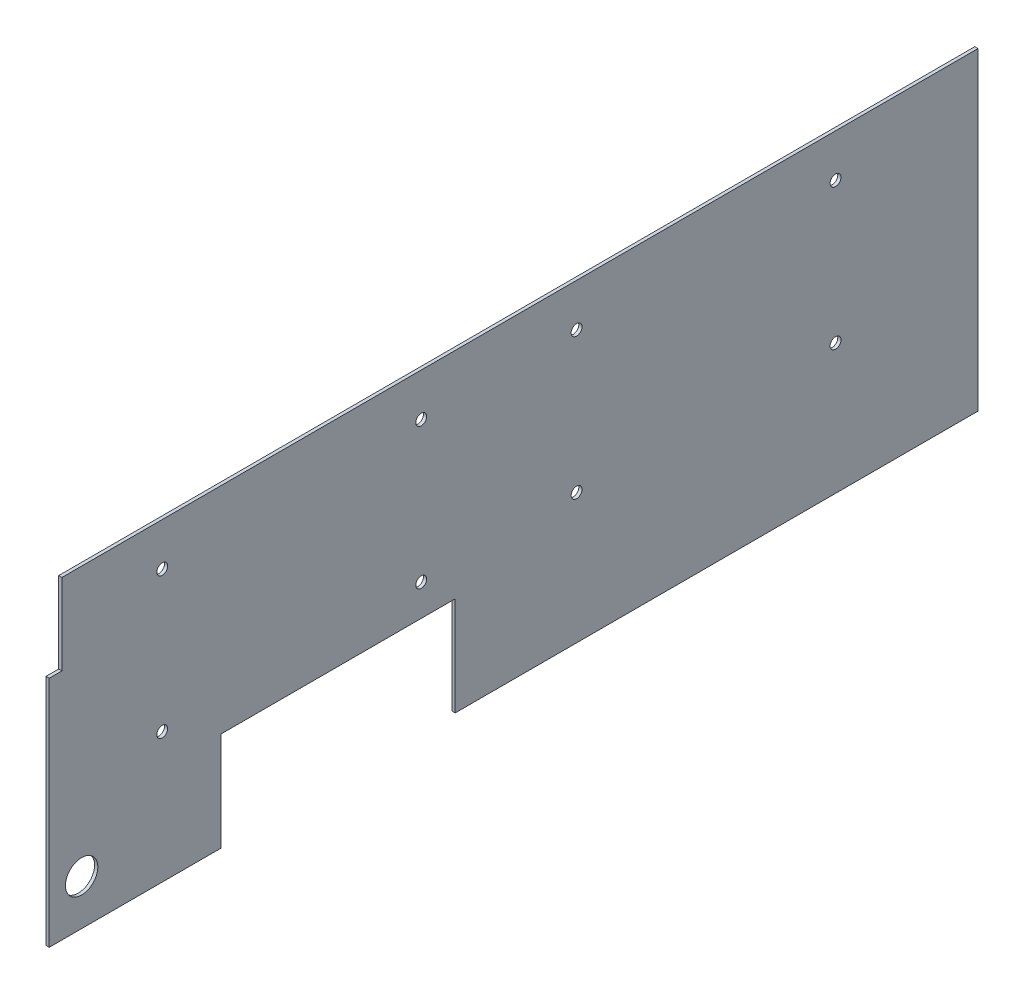
ISO-10303-21;
HEADER;
FILE_DESCRIPTION(('STEP AP214'),'2;1');
FILE_NAME('part.step','',(''),(''),'','','');
FILE_SCHEMA(('AUTOMOTIVE_DESIGN { 1 0 10303 214 1 1 1 1 }'));
ENDSEC;
DATA;
#1=APPLICATION_CONTEXT('core data for automotive mechanical design processes');
#2=APPLICATION_PROTOCOL_DEFINITION('international standard','automotive_design',2000,#1);
#3=PRODUCT_CONTEXT('',#1,'mechanical');
#4=PRODUCT('Part','Part','',(#3));
#5=PRODUCT_RELATED_PRODUCT_CATEGORY('part','',(#4));
#6=PRODUCT_DEFINITION_FORMATION('','',#4);
#7=PRODUCT_DEFINITION_CONTEXT('part definition',#1,'design');
#8=PRODUCT_DEFINITION('design','',#6,#7);
#9=PRODUCT_DEFINITION_SHAPE('','',#8);
#10=(LENGTH_UNIT() NAMED_UNIT(*) SI_UNIT(.MILLI.,.METRE.));
#11=(NAMED_UNIT(*) PLANE_ANGLE_UNIT() SI_UNIT($,.RADIAN.));
#12=(NAMED_UNIT(*) SI_UNIT($,.STERADIAN.) SOLID_ANGLE_UNIT());
#13=UNCERTAINTY_MEASURE_WITH_UNIT(LENGTH_MEASURE(1.E-05),#10,'distance_accuracy_value','');
#14=(GEOMETRIC_REPRESENTATION_CONTEXT(3) GLOBAL_UNCERTAINTY_ASSIGNED_CONTEXT((#13)) GLOBAL_UNIT_ASSIGNED_CONTEXT((#10,
#11,#12)) REPRESENTATION_CONTEXT('',''));
#15=CARTESIAN_POINT('',(0.,0.,0.));
#16=DIRECTION('',(0.,0.,1.));
#17=DIRECTION('',(1.,0.,0.));
#18=AXIS2_PLACEMENT_3D('',#15,#16,#17);
#19=CARTESIAN_POINT('',(1.5875,-76.99375,227.734090886));
#20=DIRECTION('',(0.,0.,-1.));
#21=DIRECTION('',(-1.,0.,0.));
#22=AXIS2_PLACEMENT_3D('',#19,#20,#21);
#23=PLANE('',#22);
#24=DIRECTION('',(-1.,0.,0.));
#25=VECTOR('',#24,1.);
#26=CARTESIAN_POINT('',(126.340744793055,37.30625,227.734090886));
#27=LINE('',#26,#25);
#28=CARTESIAN_POINT('',(1.58750000000001,37.30625,227.734090886));
#29=VERTEX_POINT('',#28);
#30=CARTESIAN_POINT('',(0.,37.30625,227.734090886));
#31=VERTEX_POINT('',#30);
#32=EDGE_CURVE('E176',#29,#31,#27,.T.);
#33=ORIENTED_EDGE('',*,*,#32,.T.);
#34=DIRECTION('',(0.,-1.,0.));
#35=VECTOR('',#34,1.);
#36=CARTESIAN_POINT('',(0.,-76.99375,227.734090886));
#37=LINE('',#36,#35);
#38=CARTESIAN_POINT('',(0.,-76.99375,227.734090886));
#39=VERTEX_POINT('',#38);
#40=EDGE_CURVE('E142',#31,#39,#37,.T.);
#41=ORIENTED_EDGE('',*,*,#40,.T.);
#42=DIRECTION('',(-1.,0.,0.));
#43=VECTOR('',#42,1.);
#44=CARTESIAN_POINT('',(1.5875,-76.99375,227.734090886));
#45=LINE('',#44,#43);
#46=CARTESIAN_POINT('',(1.5875,-76.99375,227.734090886));
#47=VERTEX_POINT('',#46);
#48=EDGE_CURVE('E44',#47,#39,#45,.T.);
#49=ORIENTED_EDGE('',*,*,#48,.F.);
#50=DIRECTION('',(0.,-1.,0.));
#51=VECTOR('',#50,1.);
#52=CARTESIAN_POINT('',(1.5875,-76.99375,227.734090886));
#53=LINE('',#52,#51);
#54=EDGE_CURVE('E199',#29,#47,#53,.T.);
#55=ORIENTED_EDGE('',*,*,#54,.F.);
#56=EDGE_LOOP('',(#33,#41,#49,#55));
#57=FACE_BOUND('',#56,.T.);
#58=ADVANCED_FACE('F36',(#57),#23,.F.);
#59=CARTESIAN_POINT('',(1.5875,-76.99375,227.734090886));
#60=DIRECTION('',(0.,1.,0.));
#61=DIRECTION('',(0.,0.,1.));
#62=AXIS2_PLACEMENT_3D('',#59,#60,#61);
#63=PLANE('',#62);
#64=DIRECTION('',(-1.,0.,0.));
#65=VECTOR('',#64,1.);
#66=CARTESIAN_POINT('',(126.340744793055,-76.99375,28.647159114));
#67=LINE('',#66,#65);
#68=CARTESIAN_POINT('',(1.58750000000001,-76.99375,28.647159114));
#69=VERTEX_POINT('',#68);
#70=CARTESIAN_POINT('',(0.,-76.99375,28.647159114));
#71=VERTEX_POINT('',#70);
#72=EDGE_CURVE('E117',#69,#71,#67,.T.);
#73=ORIENTED_EDGE('',*,*,#72,.T.);
#74=DIRECTION('',(0.,0.,-1.));
#75=VECTOR('',#74,1.);
#76=CARTESIAN_POINT('',(0.,-76.99375,227.734090886));
#77=LINE('',#76,#75);
#78=CARTESIAN_POINT('',(0.,-76.99375,-227.734090886));
#79=VERTEX_POINT('',#78);
#80=EDGE_CURVE('E132',#71,#79,#77,.T.);
#81=ORIENTED_EDGE('',*,*,#80,.T.);
#82=DIRECTION('',(-1.,0.,0.));
#83=VECTOR('',#82,1.);
#84=CARTESIAN_POINT('',(1.5875,-76.99375,-227.734090886));
#85=LINE('',#84,#83);
#86=CARTESIAN_POINT('',(1.5875,-76.99375,-227.734090886));
#87=VERTEX_POINT('',#86);
#88=EDGE_CURVE('E150',#87,#79,#85,.T.);
#89=ORIENTED_EDGE('',*,*,#88,.F.);
#90=DIRECTION('',(0.,0.,-1.));
#91=VECTOR('',#90,1.);
#92=CARTESIAN_POINT('',(1.5875,-76.99375,227.734090886));
#93=LINE('',#92,#91);
#94=EDGE_CURVE('E134',#69,#87,#93,.T.);
#95=ORIENTED_EDGE('',*,*,#94,.F.);
#96=EDGE_LOOP('',(#73,#81,#89,#95));
#97=FACE_BOUND('',#96,.T.);
#98=ADVANCED_FACE('F130',(#97),#63,.F.);
#99=CARTESIAN_POINT('',(1.5875,0.,0.));
#100=DIRECTION('',(-1.,0.,0.));
#101=DIRECTION('',(0.,0.,1.));
#102=AXIS2_PLACEMENT_3D('',#99,#100,#101);
#103=PLANE('',#102);
#104=CARTESIAN_POINT('',(1.5875,55.959375,-30.884090886));
#105=DIRECTION('',(1.,0.,0.));
#106=DIRECTION('',(0.,0.,-1.));
#107=AXIS2_PLACEMENT_3D('',#104,#105,#106);
#108=CIRCLE('',#107,2.667);
#109=CARTESIAN_POINT('',(1.5875,55.959375,-33.551090886));
#110=VERTEX_POINT('',#109);
#111=EDGE_CURVE('E311',#110,#110,#108,.T.);
#112=ORIENTED_EDGE('',*,*,#111,.F.);
#113=EDGE_LOOP('',(#112));
#114=FACE_BOUND('',#113,.T.);
#115=CARTESIAN_POINT('',(1.5875,55.959375,45.315909114));
#116=DIRECTION('',(1.,0.,0.));
#117=DIRECTION('',(0.,0.,-1.));
#118=AXIS2_PLACEMENT_3D('',#115,#116,#117);
#119=CIRCLE('',#118,2.667);
#120=CARTESIAN_POINT('',(1.5875,55.959375,42.648909114));
#121=VERTEX_POINT('',#120);
#122=EDGE_CURVE('E319',#121,#121,#119,.T.);
#123=ORIENTED_EDGE('',*,*,#122,.F.);
#124=EDGE_LOOP('',(#123));
#125=FACE_BOUND('',#124,.T.);
#126=CARTESIAN_POINT('',(1.5875,55.959375,172.315909114));
#127=DIRECTION('',(1.,0.,0.));
#128=DIRECTION('',(0.,0.,-1.));
#129=AXIS2_PLACEMENT_3D('',#126,#127,#128);
#130=CIRCLE('',#129,2.667);
#131=CARTESIAN_POINT('',(1.5875,55.959375,169.648909114));
#132=VERTEX_POINT('',#131);
#133=EDGE_CURVE('E325',#132,#132,#130,.T.);
#134=ORIENTED_EDGE('',*,*,#133,.F.);
#135=EDGE_LOOP('',(#134));
#136=FACE_BOUND('',#135,.T.);
#137=CARTESIAN_POINT('',(1.5875,-13.096875,172.315909114));
#138=DIRECTION('',(1.,0.,0.));
#139=DIRECTION('',(0.,0.,-1.));
#140=AXIS2_PLACEMENT_3D('',#137,#138,#139);
#141=CIRCLE('',#140,2.667);
#142=CARTESIAN_POINT('',(1.5875,-13.096875,169.648909114));
#143=VERTEX_POINT('',#142);
#144=EDGE_CURVE('E292',#143,#143,#141,.T.);
#145=ORIENTED_EDGE('',*,*,#144,.F.);
#146=EDGE_LOOP('',(#145));
#147=FACE_BOUND('',#146,.T.);
#148=CARTESIAN_POINT('',(1.5875,-13.096875,45.315909114));
#149=DIRECTION('',(1.,0.,0.));
#150=DIRECTION('',(0.,0.,-1.));
#151=AXIS2_PLACEMENT_3D('',#148,#149,#150);
#152=CIRCLE('',#151,2.667);
#153=CARTESIAN_POINT('',(1.5875,-13.096875,42.648909114));
#154=VERTEX_POINT('',#153);
#155=EDGE_CURVE('E287',#154,#154,#152,.T.);
#156=ORIENTED_EDGE('',*,*,#155,.F.);
#157=EDGE_LOOP('',(#156));
#158=FACE_BOUND('',#157,.T.);
#159=CARTESIAN_POINT('',(1.5875,-13.096875,-30.884090886));
#160=DIRECTION('',(1.,0.,0.));
#161=DIRECTION('',(0.,0.,-1.));
#162=AXIS2_PLACEMENT_3D('',#159,#160,#161);
#163=CIRCLE('',#162,2.667);
#164=CARTESIAN_POINT('',(1.5875,-13.096875,-33.551090886));
#165=VERTEX_POINT('',#164);
#166=EDGE_CURVE('E300',#165,#165,#163,.T.);
#167=ORIENTED_EDGE('',*,*,#166,.F.);
#168=EDGE_LOOP('',(#167));
#169=FACE_BOUND('',#168,.T.);
#170=CARTESIAN_POINT('',(1.5875,-13.096875,-157.884090886));
#171=DIRECTION('',(1.,0.,0.));
#172=DIRECTION('',(0.,0.,-1.));
#173=AXIS2_PLACEMENT_3D('',#170,#171,#172);
#174=CIRCLE('',#173,2.66700000000002);
#175=CARTESIAN_POINT('',(1.5875,-13.096875,-160.551090886));
#176=VERTEX_POINT('',#175);
#177=EDGE_CURVE('E306',#176,#176,#174,.T.);
#178=ORIENTED_EDGE('',*,*,#177,.F.);
#179=EDGE_LOOP('',(#178));
#180=FACE_BOUND('',#179,.T.);
#181=CARTESIAN_POINT('',(1.5875,55.959375,-157.884090886));
#182=DIRECTION('',(1.,0.,0.));
#183=DIRECTION('',(0.,0.,-1.));
#184=AXIS2_PLACEMENT_3D('',#181,#182,#183);
#185=CIRCLE('',#184,2.66700000000002);
#186=CARTESIAN_POINT('',(1.5875,55.959375,-160.551090886));
#187=VERTEX_POINT('',#186);
#188=EDGE_CURVE('E318',#187,#187,#185,.T.);
#189=ORIENTED_EDGE('',*,*,#188,.F.);
#190=EDGE_LOOP('',(#189));
#191=FACE_BOUND('',#190,.T.);
#192=CARTESIAN_POINT('',(1.58750000000001,-54.7687499999999,211.85909093172));
#193=DIRECTION('',(-1.,0.,0.));
#194=DIRECTION('',(0.,0.,1.));
#195=AXIS2_PLACEMENT_3D('',#192,#193,#194);
#196=CIRCLE('',#195,7.93750000000001);
#197=CARTESIAN_POINT('',(1.58750000000001,-54.7687499999999,219.79659093172));
#198=VERTEX_POINT('',#197);
#199=EDGE_CURVE('E180',#198,#198,#196,.F.);
#200=ORIENTED_EDGE('',*,*,#199,.F.);
#201=EDGE_LOOP('',(#200));
#202=FACE_BOUND('',#201,.T.);
#203=DIRECTION('',(0.,-1.,0.));
#204=VECTOR('',#203,1.);
#205=CARTESIAN_POINT('',(1.58750000000001,0.,28.647159114));
#206=LINE('',#205,#204);
#207=CARTESIAN_POINT('',(1.58750000000001,-28.5169491392768,28.647159114));
#208=VERTEX_POINT('',#207);
#209=EDGE_CURVE('E202',#208,#69,#206,.T.);
#210=ORIENTED_EDGE('',*,*,#209,.T.);
#211=ORIENTED_EDGE('',*,*,#94,.T.);
#212=DIRECTION('',(0.,1.,0.));
#213=VECTOR('',#212,1.);
#214=CARTESIAN_POINT('',(1.5875,-76.99375,-227.734090886));
#215=LINE('',#214,#213);
#216=CARTESIAN_POINT('',(1.5875,76.99375,-227.734090886));
#217=VERTEX_POINT('',#216);
#218=EDGE_CURVE('E145',#87,#217,#215,.T.);
#219=ORIENTED_EDGE('',*,*,#218,.T.);
#220=DIRECTION('',(0.,0.,1.));
#221=VECTOR('',#220,1.);
#222=CARTESIAN_POINT('',(1.5875,76.99375,227.734090886));
#223=LINE('',#222,#221);
#224=CARTESIAN_POINT('',(1.58750000000001,76.99375,221.528409114));
#225=VERTEX_POINT('',#224);
#226=EDGE_CURVE('E196',#217,#225,#223,.T.);
#227=ORIENTED_EDGE('',*,*,#226,.T.);
#228=DIRECTION('',(0.,1.,0.));
#229=VECTOR('',#228,1.);
#230=CARTESIAN_POINT('',(1.58750000000001,0.,221.528409114));
#231=LINE('',#230,#229);
#232=CARTESIAN_POINT('',(1.58750000000001,37.3062500000001,221.528409114));
#233=VERTEX_POINT('',#232);
#234=EDGE_CURVE('E126',#233,#225,#231,.T.);
#235=ORIENTED_EDGE('',*,*,#234,.F.);
#236=DIRECTION('',(0.,0.,1.));
#237=VECTOR('',#236,1.);
#238=CARTESIAN_POINT('',(1.58750000000001,37.306250000002,3.33712388373696E-13));
#239=LINE('',#238,#237);
#240=EDGE_CURVE('E173',#233,#29,#239,.T.);
#241=ORIENTED_EDGE('',*,*,#240,.T.);
#242=ORIENTED_EDGE('',*,*,#54,.T.);
#243=CARTESIAN_POINT('',(1.58750000000001,-76.99375,143.596590886));
#244=VERTEX_POINT('',#243);
#245=EDGE_CURVE('E151',#47,#244,#93,.T.);
#246=ORIENTED_EDGE('',*,*,#245,.T.);
#247=DIRECTION('',(0.,-1.,0.));
#248=VECTOR('',#247,1.);
#249=CARTESIAN_POINT('',(1.58750000000001,0.,143.596590886));
#250=LINE('',#249,#248);
#251=CARTESIAN_POINT('',(1.58750000000001,-28.5169491392767,143.596590886));
#252=VERTEX_POINT('',#251);
#253=EDGE_CURVE('E169',#252,#244,#250,.T.);
#254=ORIENTED_EDGE('',*,*,#253,.F.);
#255=DIRECTION('',(0.,0.,1.));
#256=VECTOR('',#255,1.);
#257=CARTESIAN_POINT('',(1.58750000000001,-28.5169491392768,0.));
#258=LINE('',#257,#256);
#259=EDGE_CURVE('E337',#208,#252,#258,.T.);
#260=ORIENTED_EDGE('',*,*,#259,.F.);
#261=EDGE_LOOP('',(#210,#211,#219,#227,#235,#241,#242,#246,#254,#260));
#262=FACE_BOUND('',#261,.T.);
#263=ADVANCED_FACE('F212',(#114,#125,#136,#147,#158,#169,#180,#191,#202,#262),#103,.F.);
#264=CARTESIAN_POINT('',(0.,0.,0.));
#265=DIRECTION('',(-1.,0.,0.));
#266=DIRECTION('',(0.,0.,1.));
#267=AXIS2_PLACEMENT_3D('',#264,#265,#266);
#268=PLANE('',#267);
#269=CARTESIAN_POINT('',(0.,55.959375,-30.884090886));
#270=DIRECTION('',(-1.,0.,0.));
#271=DIRECTION('',(0.,0.,1.));
#272=AXIS2_PLACEMENT_3D('',#269,#270,#271);
#273=CIRCLE('',#272,2.667);
#274=CARTESIAN_POINT('',(0.,55.959375,-28.217090886));
#275=VERTEX_POINT('',#274);
#276=EDGE_CURVE('E314',#275,#275,#273,.F.);
#277=ORIENTED_EDGE('',*,*,#276,.T.);
#278=EDGE_LOOP('',(#277));
#279=FACE_BOUND('',#278,.T.);
#280=CARTESIAN_POINT('',(0.,55.959375,45.315909114));
#281=DIRECTION('',(-1.,0.,0.));
#282=DIRECTION('',(0.,0.,1.));
#283=AXIS2_PLACEMENT_3D('',#280,#281,#282);
#284=CIRCLE('',#283,2.667);
#285=CARTESIAN_POINT('',(0.,55.959375,47.982909114));
#286=VERTEX_POINT('',#285);
#287=EDGE_CURVE('E315',#286,#286,#284,.F.);
#288=ORIENTED_EDGE('',*,*,#287,.T.);
#289=EDGE_LOOP('',(#288));
#290=FACE_BOUND('',#289,.T.);
#291=CARTESIAN_POINT('',(0.,55.959375,172.315909114));
#292=DIRECTION('',(-1.,0.,0.));
#293=DIRECTION('',(0.,0.,1.));
#294=AXIS2_PLACEMENT_3D('',#291,#292,#293);
#295=CIRCLE('',#294,2.667);
#296=CARTESIAN_POINT('',(0.,55.959375,174.982909114));
#297=VERTEX_POINT('',#296);
#298=EDGE_CURVE('E322',#297,#297,#295,.F.);
#299=ORIENTED_EDGE('',*,*,#298,.T.);
#300=EDGE_LOOP('',(#299));
#301=FACE_BOUND('',#300,.T.);
#302=CARTESIAN_POINT('',(0.,-13.096875,172.315909114));
#303=DIRECTION('',(-1.,0.,0.));
#304=DIRECTION('',(0.,0.,1.));
#305=AXIS2_PLACEMENT_3D('',#302,#303,#304);
#306=CIRCLE('',#305,2.667);
#307=CARTESIAN_POINT('',(0.,-13.096875,174.982909114));
#308=VERTEX_POINT('',#307);
#309=EDGE_CURVE('E295',#308,#308,#306,.F.);
#310=ORIENTED_EDGE('',*,*,#309,.T.);
#311=EDGE_LOOP('',(#310));
#312=FACE_BOUND('',#311,.T.);
#313=CARTESIAN_POINT('',(0.,-13.096875,45.315909114));
#314=DIRECTION('',(-1.,0.,0.));
#315=DIRECTION('',(0.,0.,1.));
#316=AXIS2_PLACEMENT_3D('',#313,#314,#315);
#317=CIRCLE('',#316,2.667);
#318=CARTESIAN_POINT('',(0.,-13.096875,47.982909114));
#319=VERTEX_POINT('',#318);
#320=EDGE_CURVE('E290',#319,#319,#317,.F.);
#321=ORIENTED_EDGE('',*,*,#320,.T.);
#322=EDGE_LOOP('',(#321));
#323=FACE_BOUND('',#322,.T.);
#324=CARTESIAN_POINT('',(0.,-13.096875,-30.884090886));
#325=DIRECTION('',(-1.,0.,0.));
#326=DIRECTION('',(0.,0.,1.));
#327=AXIS2_PLACEMENT_3D('',#324,#325,#326);
#328=CIRCLE('',#327,2.667);
#329=CARTESIAN_POINT('',(0.,-13.096875,-28.217090886));
#330=VERTEX_POINT('',#329);
#331=EDGE_CURVE('E297',#330,#330,#328,.F.);
#332=ORIENTED_EDGE('',*,*,#331,.T.);
#333=EDGE_LOOP('',(#332));
#334=FACE_BOUND('',#333,.T.);
#335=CARTESIAN_POINT('',(0.,-13.096875,-157.884090886));
#336=DIRECTION('',(-1.,0.,0.));
#337=DIRECTION('',(0.,0.,1.));
#338=AXIS2_PLACEMENT_3D('',#335,#336,#337);
#339=CIRCLE('',#338,2.66700000000002);
#340=CARTESIAN_POINT('',(0.,-13.096875,-155.217090886));
#341=VERTEX_POINT('',#340);
#342=EDGE_CURVE('E303',#341,#341,#339,.F.);
#343=ORIENTED_EDGE('',*,*,#342,.T.);
#344=EDGE_LOOP('',(#343));
#345=FACE_BOUND('',#344,.T.);
#346=CARTESIAN_POINT('',(0.,55.959375,-157.884090886));
#347=DIRECTION('',(-1.,0.,0.));
#348=DIRECTION('',(0.,0.,1.));
#349=AXIS2_PLACEMENT_3D('',#346,#347,#348);
#350=CIRCLE('',#349,2.66700000000002);
#351=CARTESIAN_POINT('',(0.,55.959375,-155.217090886));
#352=VERTEX_POINT('',#351);
#353=EDGE_CURVE('E191',#352,#352,#350,.F.);
#354=ORIENTED_EDGE('',*,*,#353,.T.);
#355=EDGE_LOOP('',(#354));
#356=FACE_BOUND('',#355,.T.);
#357=CARTESIAN_POINT('',(0.,-54.7687499999999,211.85909093172));
#358=DIRECTION('',(-1.,0.,0.));
#359=DIRECTION('',(0.,0.,1.));
#360=AXIS2_PLACEMENT_3D('',#357,#358,#359);
#361=CIRCLE('',#360,7.93750000000001);
#362=CARTESIAN_POINT('',(0.,-54.7687499999999,219.79659093172));
#363=VERTEX_POINT('',#362);
#364=EDGE_CURVE('E188',#363,#363,#361,.T.);
#365=ORIENTED_EDGE('',*,*,#364,.F.);
#366=EDGE_LOOP('',(#365));
#367=FACE_BOUND('',#366,.T.);
#368=ORIENTED_EDGE('',*,*,#80,.F.);
#369=DIRECTION('',(0.,1.,0.));
#370=VECTOR('',#369,1.);
#371=CARTESIAN_POINT('',(0.,0.,28.647159114));
#372=LINE('',#371,#370);
#373=CARTESIAN_POINT('',(0.,-28.5169491392768,28.647159114));
#374=VERTEX_POINT('',#373);
#375=EDGE_CURVE('E114',#71,#374,#372,.T.);
#376=ORIENTED_EDGE('',*,*,#375,.T.);
#377=DIRECTION('',(0.,0.,-1.));
#378=VECTOR('',#377,1.);
#379=CARTESIAN_POINT('',(0.,-28.5169491392768,0.));
#380=LINE('',#379,#378);
#381=CARTESIAN_POINT('',(0.,-28.5169491392767,143.596590886));
#382=VERTEX_POINT('',#381);
#383=EDGE_CURVE('E135',#382,#374,#380,.T.);
#384=ORIENTED_EDGE('',*,*,#383,.F.);
#385=DIRECTION('',(0.,1.,0.));
#386=VECTOR('',#385,1.);
#387=CARTESIAN_POINT('',(0.,0.,143.596590886));
#388=LINE('',#387,#386);
#389=CARTESIAN_POINT('',(0.,-76.99375,143.596590886));
#390=VERTEX_POINT('',#389);
#391=EDGE_CURVE('E125',#390,#382,#388,.T.);
#392=ORIENTED_EDGE('',*,*,#391,.F.);
#393=EDGE_CURVE('E141',#39,#390,#77,.T.);
#394=ORIENTED_EDGE('',*,*,#393,.F.);
#395=ORIENTED_EDGE('',*,*,#40,.F.);
#396=DIRECTION('',(0.,0.,-1.));
#397=VECTOR('',#396,1.);
#398=CARTESIAN_POINT('',(0.,37.306250000002,3.33712388373696E-13));
#399=LINE('',#398,#397);
#400=CARTESIAN_POINT('',(0.,37.3062500000001,221.528409114));
#401=VERTEX_POINT('',#400);
#402=EDGE_CURVE('E179',#31,#401,#399,.T.);
#403=ORIENTED_EDGE('',*,*,#402,.T.);
#404=DIRECTION('',(0.,-1.,0.));
#405=VECTOR('',#404,1.);
#406=CARTESIAN_POINT('',(0.,0.,221.528409114));
#407=LINE('',#406,#405);
#408=CARTESIAN_POINT('',(0.,76.99375,221.528409114));
#409=VERTEX_POINT('',#408);
#410=EDGE_CURVE('E177',#409,#401,#407,.T.);
#411=ORIENTED_EDGE('',*,*,#410,.F.);
#412=DIRECTION('',(0.,0.,1.));
#413=VECTOR('',#412,1.);
#414=CARTESIAN_POINT('',(0.,76.99375,227.734090886));
#415=LINE('',#414,#413);
#416=CARTESIAN_POINT('',(0.,76.99375,-227.734090886));
#417=VERTEX_POINT('',#416);
#418=EDGE_CURVE('E146',#417,#409,#415,.T.);
#419=ORIENTED_EDGE('',*,*,#418,.F.);
#420=DIRECTION('',(0.,1.,0.));
#421=VECTOR('',#420,1.);
#422=CARTESIAN_POINT('',(0.,-76.99375,-227.734090886));
#423=LINE('',#422,#421);
#424=EDGE_CURVE('E140',#79,#417,#423,.T.);
#425=ORIENTED_EDGE('',*,*,#424,.F.);
#426=EDGE_LOOP('',(#368,#376,#384,#392,#394,#395,#403,#411,#419,#425));
#427=FACE_BOUND('',#426,.T.);
#428=ADVANCED_FACE('F138',(#279,#290,#301,#312,#323,#334,#345,#356,#367,#427),#268,.T.);
#429=CARTESIAN_POINT('',(1.5875,-76.99375,-227.734090886));
#430=DIRECTION('',(0.,0.,1.));
#431=DIRECTION('',(1.,0.,0.));
#432=AXIS2_PLACEMENT_3D('',#429,#430,#431);
#433=PLANE('',#432);
#434=ORIENTED_EDGE('',*,*,#424,.T.);
#435=DIRECTION('',(-1.,0.,0.));
#436=VECTOR('',#435,1.);
#437=CARTESIAN_POINT('',(1.5875,76.99375,-227.734090886));
#438=LINE('',#437,#436);
#439=EDGE_CURVE('E11',#217,#417,#438,.T.);
#440=ORIENTED_EDGE('',*,*,#439,.F.);
#441=ORIENTED_EDGE('',*,*,#218,.F.);
#442=ORIENTED_EDGE('',*,*,#88,.T.);
#443=EDGE_LOOP('',(#434,#440,#441,#442));
#444=FACE_BOUND('',#443,.T.);
#445=ADVANCED_FACE('F38',(#444),#433,.F.);
#446=CARTESIAN_POINT('',(1.5875,76.99375,227.734090886));
#447=DIRECTION('',(0.,-1.,0.));
#448=DIRECTION('',(0.,0.,-1.));
#449=AXIS2_PLACEMENT_3D('',#446,#447,#448);
#450=PLANE('',#449);
#451=ORIENTED_EDGE('',*,*,#418,.T.);
#452=DIRECTION('',(-1.,0.,0.));
#453=VECTOR('',#452,1.);
#454=CARTESIAN_POINT('',(126.340744793055,76.99375,221.528409114));
#455=LINE('',#454,#453);
#456=EDGE_CURVE('E51',#225,#409,#455,.T.);
#457=ORIENTED_EDGE('',*,*,#456,.F.);
#458=ORIENTED_EDGE('',*,*,#226,.F.);
#459=ORIENTED_EDGE('',*,*,#439,.T.);
#460=EDGE_LOOP('',(#451,#457,#458,#459));
#461=FACE_BOUND('',#460,.T.);
#462=ADVANCED_FACE('F205',(#461),#450,.F.);
#463=ORIENTED_EDGE('',*,*,#393,.T.);
#464=DIRECTION('',(-1.,0.,0.));
#465=VECTOR('',#464,1.);
#466=CARTESIAN_POINT('',(126.340744793055,-76.99375,143.596590886));
#467=LINE('',#466,#465);
#468=EDGE_CURVE('E59',#244,#390,#467,.T.);
#469=ORIENTED_EDGE('',*,*,#468,.F.);
#470=ORIENTED_EDGE('',*,*,#245,.F.);
#471=ORIENTED_EDGE('',*,*,#48,.T.);
#472=EDGE_LOOP('',(#463,#469,#470,#471));
#473=FACE_BOUND('',#472,.T.);
#474=ADVANCED_FACE('F157',(#473),#63,.F.);
#475=CARTESIAN_POINT('',(126.340744793055,-54.7687499999999,211.85909093172));
#476=DIRECTION('',(-1.,0.,0.));
#477=DIRECTION('',(0.,0.,1.));
#478=AXIS2_PLACEMENT_3D('',#475,#476,#477);
#479=CYLINDRICAL_SURFACE('',#478,7.93750000000001);
#480=ORIENTED_EDGE('',*,*,#199,.T.);
#481=EDGE_LOOP('',(#480));
#482=FACE_BOUND('',#481,.T.);
#483=ORIENTED_EDGE('',*,*,#364,.T.);
#484=EDGE_LOOP('',(#483));
#485=FACE_BOUND('',#484,.T.);
#486=ADVANCED_FACE('F229',(#482,#485),#479,.F.);
#487=CARTESIAN_POINT('',(126.340744793055,37.306250000002,3.33712388373696E-13));
#488=DIRECTION('',(0.,1.,0.));
#489=DIRECTION('',(0.,0.,1.));
#490=AXIS2_PLACEMENT_3D('',#487,#488,#489);
#491=PLANE('',#490);
#492=DIRECTION('',(-1.,0.,0.));
#493=VECTOR('',#492,1.);
#494=CARTESIAN_POINT('',(126.340744793055,37.3062500000001,221.528409114));
#495=LINE('',#494,#493);
#496=EDGE_CURVE('E184',#233,#401,#495,.T.);
#497=ORIENTED_EDGE('',*,*,#496,.T.);
#498=ORIENTED_EDGE('',*,*,#402,.F.);
#499=ORIENTED_EDGE('',*,*,#32,.F.);
#500=ORIENTED_EDGE('',*,*,#240,.F.);
#501=EDGE_LOOP('',(#497,#498,#499,#500));
#502=FACE_BOUND('',#501,.T.);
#503=ADVANCED_FACE('F236',(#502),#491,.T.);
#504=CARTESIAN_POINT('',(126.340744793055,0.,221.528409114));
#505=DIRECTION('',(0.,0.,-1.));
#506=DIRECTION('',(-1.,0.,0.));
#507=AXIS2_PLACEMENT_3D('',#504,#505,#506);
#508=PLANE('',#507);
#509=ORIENTED_EDGE('',*,*,#234,.T.);
#510=ORIENTED_EDGE('',*,*,#456,.T.);
#511=ORIENTED_EDGE('',*,*,#410,.T.);
#512=ORIENTED_EDGE('',*,*,#496,.F.);
#513=EDGE_LOOP('',(#509,#510,#511,#512));
#514=FACE_BOUND('',#513,.T.);
#515=ADVANCED_FACE('F208',(#514),#508,.F.);
#516=CARTESIAN_POINT('',(126.340744793055,0.,28.647159114));
#517=DIRECTION('',(0.,0.,1.));
#518=DIRECTION('',(0.,-1.,0.));
#519=AXIS2_PLACEMENT_3D('',#516,#517,#518);
#520=PLANE('',#519);
#521=DIRECTION('',(-1.,0.,0.));
#522=VECTOR('',#521,1.);
#523=CARTESIAN_POINT('',(126.340744793055,-28.5169491392768,28.647159114));
#524=LINE('',#523,#522);
#525=EDGE_CURVE('E120',#208,#374,#524,.T.);
#526=ORIENTED_EDGE('',*,*,#525,.T.);
#527=ORIENTED_EDGE('',*,*,#375,.F.);
#528=ORIENTED_EDGE('',*,*,#72,.F.);
#529=ORIENTED_EDGE('',*,*,#209,.F.);
#530=EDGE_LOOP('',(#526,#527,#528,#529));
#531=FACE_BOUND('',#530,.T.);
#532=ADVANCED_FACE('F116',(#531),#520,.T.);
#533=CARTESIAN_POINT('',(126.340744793055,-28.5169491392768,0.));
#534=DIRECTION('',(0.,1.,0.));
#535=DIRECTION('',(0.,0.,1.));
#536=AXIS2_PLACEMENT_3D('',#533,#534,#535);
#537=PLANE('',#536);
#538=ORIENTED_EDGE('',*,*,#259,.T.);
#539=DIRECTION('',(-1.,0.,0.));
#540=VECTOR('',#539,1.);
#541=CARTESIAN_POINT('',(126.340744793055,-28.5169491392767,143.596590886));
#542=LINE('',#541,#540);
#543=EDGE_CURVE('E170',#252,#382,#542,.T.);
#544=ORIENTED_EDGE('',*,*,#543,.T.);
#545=ORIENTED_EDGE('',*,*,#383,.T.);
#546=ORIENTED_EDGE('',*,*,#525,.F.);
#547=EDGE_LOOP('',(#538,#544,#545,#546));
#548=FACE_BOUND('',#547,.T.);
#549=ADVANCED_FACE('F244',(#548),#537,.F.);
#550=CARTESIAN_POINT('',(126.340744793055,0.,143.596590886));
#551=DIRECTION('',(0.,0.,1.));
#552=DIRECTION('',(1.,0.,0.));
#553=AXIS2_PLACEMENT_3D('',#550,#551,#552);
#554=PLANE('',#553);
#555=ORIENTED_EDGE('',*,*,#253,.T.);
#556=ORIENTED_EDGE('',*,*,#468,.T.);
#557=ORIENTED_EDGE('',*,*,#391,.T.);
#558=ORIENTED_EDGE('',*,*,#543,.F.);
#559=EDGE_LOOP('',(#555,#556,#557,#558));
#560=FACE_BOUND('',#559,.T.);
#561=ADVANCED_FACE('F245',(#560),#554,.F.);
#562=CARTESIAN_POINT('',(-7.54341514169816,55.959375,-157.884090886));
#563=DIRECTION('',(1.,0.,0.));
#564=DIRECTION('',(0.,0.,-1.));
#565=AXIS2_PLACEMENT_3D('',#562,#563,#564);
#566=CYLINDRICAL_SURFACE('',#565,2.66700000000002);
#567=ORIENTED_EDGE('',*,*,#188,.T.);
#568=EDGE_LOOP('',(#567));
#569=FACE_BOUND('',#568,.T.);
#570=ORIENTED_EDGE('',*,*,#353,.F.);
#571=EDGE_LOOP('',(#570));
#572=FACE_BOUND('',#571,.T.);
#573=ADVANCED_FACE('F248',(#569,#572),#566,.F.);
#574=CARTESIAN_POINT('',(-7.54341514169816,-13.096875,-157.884090886));
#575=DIRECTION('',(1.,0.,0.));
#576=DIRECTION('',(0.,0.,-1.));
#577=AXIS2_PLACEMENT_3D('',#574,#575,#576);
#578=CYLINDRICAL_SURFACE('',#577,2.66700000000002);
#579=ORIENTED_EDGE('',*,*,#177,.T.);
#580=EDGE_LOOP('',(#579));
#581=FACE_BOUND('',#580,.T.);
#582=ORIENTED_EDGE('',*,*,#342,.F.);
#583=EDGE_LOOP('',(#582));
#584=FACE_BOUND('',#583,.T.);
#585=ADVANCED_FACE('F254',(#581,#584),#578,.F.);
#586=CARTESIAN_POINT('',(-7.54341514169816,-13.096875,-30.884090886));
#587=DIRECTION('',(1.,0.,0.));
#588=DIRECTION('',(0.,0.,-1.));
#589=AXIS2_PLACEMENT_3D('',#586,#587,#588);
#590=CYLINDRICAL_SURFACE('',#589,2.667);
#591=ORIENTED_EDGE('',*,*,#166,.T.);
#592=EDGE_LOOP('',(#591));
#593=FACE_BOUND('',#592,.T.);
#594=ORIENTED_EDGE('',*,*,#331,.F.);
#595=EDGE_LOOP('',(#594));
#596=FACE_BOUND('',#595,.T.);
#597=ADVANCED_FACE('F275',(#593,#596),#590,.F.);
#598=CARTESIAN_POINT('',(-7.54341514169816,-13.096875,45.315909114));
#599=DIRECTION('',(1.,0.,0.));
#600=DIRECTION('',(0.,0.,-1.));
#601=AXIS2_PLACEMENT_3D('',#598,#599,#600);
#602=CYLINDRICAL_SURFACE('',#601,2.667);
#603=ORIENTED_EDGE('',*,*,#155,.T.);
#604=EDGE_LOOP('',(#603));
#605=FACE_BOUND('',#604,.T.);
#606=ORIENTED_EDGE('',*,*,#320,.F.);
#607=EDGE_LOOP('',(#606));
#608=FACE_BOUND('',#607,.T.);
#609=ADVANCED_FACE('F260',(#605,#608),#602,.F.);
#610=CARTESIAN_POINT('',(-7.54341514169816,-13.096875,172.315909114));
#611=DIRECTION('',(1.,0.,0.));
#612=DIRECTION('',(0.,0.,-1.));
#613=AXIS2_PLACEMENT_3D('',#610,#611,#612);
#614=CYLINDRICAL_SURFACE('',#613,2.667);
#615=ORIENTED_EDGE('',*,*,#144,.T.);
#616=EDGE_LOOP('',(#615));
#617=FACE_BOUND('',#616,.T.);
#618=ORIENTED_EDGE('',*,*,#309,.F.);
#619=EDGE_LOOP('',(#618));
#620=FACE_BOUND('',#619,.T.);
#621=ADVANCED_FACE('F256',(#617,#620),#614,.F.);
#622=CARTESIAN_POINT('',(-7.54341514169816,55.959375,172.315909114));
#623=DIRECTION('',(1.,0.,0.));
#624=DIRECTION('',(0.,0.,-1.));
#625=AXIS2_PLACEMENT_3D('',#622,#623,#624);
#626=CYLINDRICAL_SURFACE('',#625,2.667);
#627=ORIENTED_EDGE('',*,*,#133,.T.);
#628=EDGE_LOOP('',(#627));
#629=FACE_BOUND('',#628,.T.);
#630=ORIENTED_EDGE('',*,*,#298,.F.);
#631=EDGE_LOOP('',(#630));
#632=FACE_BOUND('',#631,.T.);
#633=ADVANCED_FACE('F259',(#629,#632),#626,.F.);
#634=CARTESIAN_POINT('',(-7.54341514169816,55.959375,45.315909114));
#635=DIRECTION('',(1.,0.,0.));
#636=DIRECTION('',(0.,0.,-1.));
#637=AXIS2_PLACEMENT_3D('',#634,#635,#636);
#638=CYLINDRICAL_SURFACE('',#637,2.667);
#639=ORIENTED_EDGE('',*,*,#122,.T.);
#640=EDGE_LOOP('',(#639));
#641=FACE_BOUND('',#640,.T.);
#642=ORIENTED_EDGE('',*,*,#287,.F.);
#643=EDGE_LOOP('',(#642));
#644=FACE_BOUND('',#643,.T.);
#645=ADVANCED_FACE('F264',(#641,#644),#638,.F.);
#646=CARTESIAN_POINT('',(-7.54341514169816,55.959375,-30.884090886));
#647=DIRECTION('',(1.,0.,0.));
#648=DIRECTION('',(0.,0.,-1.));
#649=AXIS2_PLACEMENT_3D('',#646,#647,#648);
#650=CYLINDRICAL_SURFACE('',#649,2.667);
#651=ORIENTED_EDGE('',*,*,#111,.T.);
#652=EDGE_LOOP('',(#651));
#653=FACE_BOUND('',#652,.T.);
#654=ORIENTED_EDGE('',*,*,#276,.F.);
#655=EDGE_LOOP('',(#654));
#656=FACE_BOUND('',#655,.T.);
#657=ADVANCED_FACE('F268',(#653,#656),#650,.F.);
#658=CLOSED_SHELL('',(#58,#98,#263,#428,#445,#462,#474,#486,#503,#515,#532,#549,#561,#573,#585,
#597,#609,#621,#633,#645,#657));
#659=MANIFOLD_SOLID_BREP('B2',#658);
#660=ADVANCED_BREP_SHAPE_REPRESENTATION('',(#18,#659),#14);
#661=SHAPE_DEFINITION_REPRESENTATION(#9,#660);
ENDSEC;
END-ISO-10303-21;
